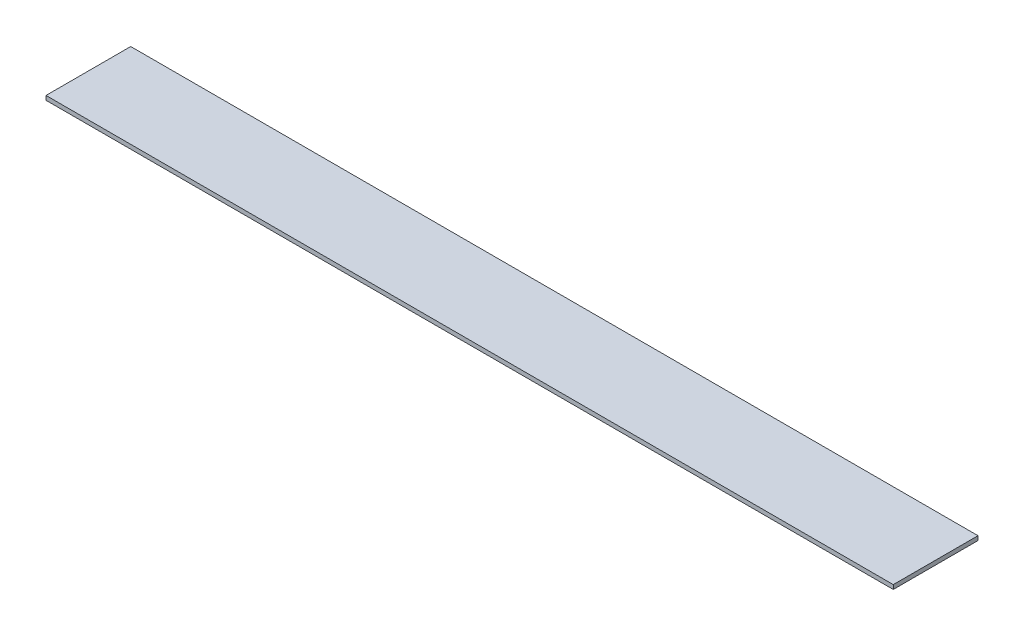
ISO-10303-21;
HEADER;
FILE_DESCRIPTION(('STEP AP214'),'2;1');
FILE_NAME('part.step','',(''),(''),'','','');
FILE_SCHEMA(('AUTOMOTIVE_DESIGN { 1 0 10303 214 1 1 1 1 }'));
ENDSEC;
DATA;
#1=APPLICATION_CONTEXT('core data for automotive mechanical design processes');
#2=APPLICATION_PROTOCOL_DEFINITION('international standard','automotive_design',2000,#1);
#3=PRODUCT_CONTEXT('',#1,'mechanical');
#4=PRODUCT('Part','Part','',(#3));
#5=PRODUCT_RELATED_PRODUCT_CATEGORY('part','',(#4));
#6=PRODUCT_DEFINITION_FORMATION('','',#4);
#7=PRODUCT_DEFINITION_CONTEXT('part definition',#1,'design');
#8=PRODUCT_DEFINITION('design','',#6,#7);
#9=PRODUCT_DEFINITION_SHAPE('','',#8);
#10=(LENGTH_UNIT() NAMED_UNIT(*) SI_UNIT(.MILLI.,.METRE.));
#11=(NAMED_UNIT(*) PLANE_ANGLE_UNIT() SI_UNIT($,.RADIAN.));
#12=(NAMED_UNIT(*) SI_UNIT($,.STERADIAN.) SOLID_ANGLE_UNIT());
#13=UNCERTAINTY_MEASURE_WITH_UNIT(LENGTH_MEASURE(1.E-05),#10,'distance_accuracy_value','');
#14=(GEOMETRIC_REPRESENTATION_CONTEXT(3) GLOBAL_UNCERTAINTY_ASSIGNED_CONTEXT((#13)) GLOBAL_UNIT_ASSIGNED_CONTEXT((#10,
#11,#12)) REPRESENTATION_CONTEXT('',''));
#15=CARTESIAN_POINT('',(0.,0.,0.));
#16=DIRECTION('',(0.,0.,1.));
#17=DIRECTION('',(1.,0.,0.));
#18=AXIS2_PLACEMENT_3D('',#15,#16,#17);
#19=CARTESIAN_POINT('',(300.,1.71683972880179E-13,0.));
#20=DIRECTION('',(-1.,0.,0.));
#21=DIRECTION('',(0.,-1.,0.));
#22=AXIS2_PLACEMENT_3D('',#19,#20,#21);
#23=PLANE('',#22);
#24=DIRECTION('',(0.,-1.,0.));
#25=VECTOR('',#24,1.);
#26=CARTESIAN_POINT('',(300.,3.43367945760358E-13,60.));
#27=LINE('',#26,#25);
#28=CARTESIAN_POINT('',(300.,-47.,60.));
#29=VERTEX_POINT('',#28);
#30=CARTESIAN_POINT('',(300.,-50.,60.));
#31=VERTEX_POINT('',#30);
#32=EDGE_CURVE('E91',#29,#31,#27,.T.);
#33=ORIENTED_EDGE('',*,*,#32,.T.);
#34=DIRECTION('',(0.,0.,-1.));
#35=VECTOR('',#34,1.);
#36=CARTESIAN_POINT('',(300.,-50.,60.));
#37=LINE('',#36,#35);
#38=CARTESIAN_POINT('',(300.,-50.,0.));
#39=VERTEX_POINT('',#38);
#40=EDGE_CURVE('E40',#31,#39,#37,.T.);
#41=ORIENTED_EDGE('',*,*,#40,.T.);
#42=DIRECTION('',(0.,-1.,0.));
#43=VECTOR('',#42,1.);
#44=CARTESIAN_POINT('',(300.,3.43367945760358E-13,0.));
#45=LINE('',#44,#43);
#46=CARTESIAN_POINT('',(300.,-47.,0.));
#47=VERTEX_POINT('',#46);
#48=EDGE_CURVE('E53',#47,#39,#45,.T.);
#49=ORIENTED_EDGE('',*,*,#48,.F.);
#50=DIRECTION('',(0.,0.,1.));
#51=VECTOR('',#50,1.);
#52=CARTESIAN_POINT('',(300.,-47.,3.));
#53=LINE('',#52,#51);
#54=EDGE_CURVE('E11',#47,#29,#53,.T.);
#55=ORIENTED_EDGE('',*,*,#54,.T.);
#56=EDGE_LOOP('',(#33,#41,#49,#55));
#57=FACE_BOUND('',#56,.T.);
#58=ADVANCED_FACE('F32',(#57),#23,.F.);
#59=CARTESIAN_POINT('',(-300.,0.,0.));
#60=DIRECTION('',(-1.,0.,0.));
#61=DIRECTION('',(0.,0.,1.));
#62=AXIS2_PLACEMENT_3D('',#59,#60,#61);
#63=PLANE('',#62);
#64=DIRECTION('',(0.,-1.,0.));
#65=VECTOR('',#64,1.);
#66=CARTESIAN_POINT('',(-300.,0.,60.));
#67=LINE('',#66,#65);
#68=CARTESIAN_POINT('',(-300.,-47.,60.));
#69=VERTEX_POINT('',#68);
#70=CARTESIAN_POINT('',(-300.,-50.,60.));
#71=VERTEX_POINT('',#70);
#72=EDGE_CURVE('E35',#69,#71,#67,.T.);
#73=ORIENTED_EDGE('',*,*,#72,.F.);
#74=DIRECTION('',(0.,0.,1.));
#75=VECTOR('',#74,1.);
#76=CARTESIAN_POINT('',(-300.,-47.,3.));
#77=LINE('',#76,#75);
#78=CARTESIAN_POINT('',(-300.,-47.,0.));
#79=VERTEX_POINT('',#78);
#80=EDGE_CURVE('E95',#79,#69,#77,.T.);
#81=ORIENTED_EDGE('',*,*,#80,.F.);
#82=DIRECTION('',(0.,-1.,0.));
#83=VECTOR('',#82,1.);
#84=CARTESIAN_POINT('',(-300.,0.,0.));
#85=LINE('',#84,#83);
#86=CARTESIAN_POINT('',(-300.,-50.,0.));
#87=VERTEX_POINT('',#86);
#88=EDGE_CURVE('E79',#79,#87,#85,.T.);
#89=ORIENTED_EDGE('',*,*,#88,.T.);
#90=DIRECTION('',(0.,0.,-1.));
#91=VECTOR('',#90,1.);
#92=CARTESIAN_POINT('',(-300.,-50.,60.));
#93=LINE('',#92,#91);
#94=EDGE_CURVE('E74',#71,#87,#93,.T.);
#95=ORIENTED_EDGE('',*,*,#94,.F.);
#96=EDGE_LOOP('',(#73,#81,#89,#95));
#97=FACE_BOUND('',#96,.T.);
#98=ADVANCED_FACE('F76',(#97),#63,.T.);
#99=CARTESIAN_POINT('',(-300.,-50.,60.));
#100=DIRECTION('',(0.,1.,0.));
#101=DIRECTION('',(0.,0.,1.));
#102=AXIS2_PLACEMENT_3D('',#99,#100,#101);
#103=PLANE('',#102);
#104=DIRECTION('',(1.,0.,0.));
#105=VECTOR('',#104,1.);
#106=CARTESIAN_POINT('',(-300.,-50.,0.));
#107=LINE('',#106,#105);
#108=EDGE_CURVE('E93',#87,#39,#107,.T.);
#109=ORIENTED_EDGE('',*,*,#108,.T.);
#110=ORIENTED_EDGE('',*,*,#40,.F.);
#111=DIRECTION('',(1.,0.,0.));
#112=VECTOR('',#111,1.);
#113=CARTESIAN_POINT('',(-300.,-50.,60.));
#114=LINE('',#113,#112);
#115=EDGE_CURVE('E84',#71,#31,#114,.T.);
#116=ORIENTED_EDGE('',*,*,#115,.F.);
#117=ORIENTED_EDGE('',*,*,#94,.T.);
#118=EDGE_LOOP('',(#109,#110,#116,#117));
#119=FACE_BOUND('',#118,.T.);
#120=ADVANCED_FACE('F92',(#119),#103,.F.);
#121=CARTESIAN_POINT('',(-300.,-47.,3.));
#122=DIRECTION('',(0.,-1.,0.));
#123=DIRECTION('',(0.,0.,-1.));
#124=AXIS2_PLACEMENT_3D('',#121,#122,#123);
#125=PLANE('',#124);
#126=DIRECTION('',(1.,0.,0.));
#127=VECTOR('',#126,1.);
#128=CARTESIAN_POINT('',(-300.,-47.,60.));
#129=LINE('',#128,#127);
#130=EDGE_CURVE('E90',#69,#29,#129,.T.);
#131=ORIENTED_EDGE('',*,*,#130,.T.);
#132=ORIENTED_EDGE('',*,*,#54,.F.);
#133=DIRECTION('',(-1.,0.,0.));
#134=VECTOR('',#133,1.);
#135=CARTESIAN_POINT('',(300.,-47.,0.));
#136=LINE('',#135,#134);
#137=EDGE_CURVE('E83',#47,#79,#136,.T.);
#138=ORIENTED_EDGE('',*,*,#137,.T.);
#139=ORIENTED_EDGE('',*,*,#80,.T.);
#140=EDGE_LOOP('',(#131,#132,#138,#139));
#141=FACE_BOUND('',#140,.T.);
#142=ADVANCED_FACE('F104',(#141),#125,.F.);
#143=CARTESIAN_POINT('',(-300.,0.,0.));
#144=DIRECTION('',(0.,0.,1.));
#145=DIRECTION('',(1.,0.,0.));
#146=AXIS2_PLACEMENT_3D('',#143,#144,#145);
#147=PLANE('',#146);
#148=ORIENTED_EDGE('',*,*,#88,.F.);
#149=ORIENTED_EDGE('',*,*,#137,.F.);
#150=ORIENTED_EDGE('',*,*,#48,.T.);
#151=ORIENTED_EDGE('',*,*,#108,.F.);
#152=EDGE_LOOP('',(#148,#149,#150,#151));
#153=FACE_BOUND('',#152,.T.);
#154=ADVANCED_FACE('F106',(#153),#147,.F.);
#155=CARTESIAN_POINT('',(-300.,0.,60.));
#156=DIRECTION('',(0.,0.,1.));
#157=DIRECTION('',(1.,0.,0.));
#158=AXIS2_PLACEMENT_3D('',#155,#156,#157);
#159=PLANE('',#158);
#160=ORIENTED_EDGE('',*,*,#130,.F.);
#161=ORIENTED_EDGE('',*,*,#72,.T.);
#162=ORIENTED_EDGE('',*,*,#115,.T.);
#163=ORIENTED_EDGE('',*,*,#32,.F.);
#164=EDGE_LOOP('',(#160,#161,#162,#163));
#165=FACE_BOUND('',#164,.T.);
#166=ADVANCED_FACE('F88',(#165),#159,.T.);
#167=CLOSED_SHELL('',(#58,#98,#120,#142,#154,#166));
#168=MANIFOLD_SOLID_BREP('B2',#167);
#169=ADVANCED_BREP_SHAPE_REPRESENTATION('',(#18,#168),#14);
#170=SHAPE_DEFINITION_REPRESENTATION(#9,#169);
ENDSEC;
END-ISO-10303-21;
